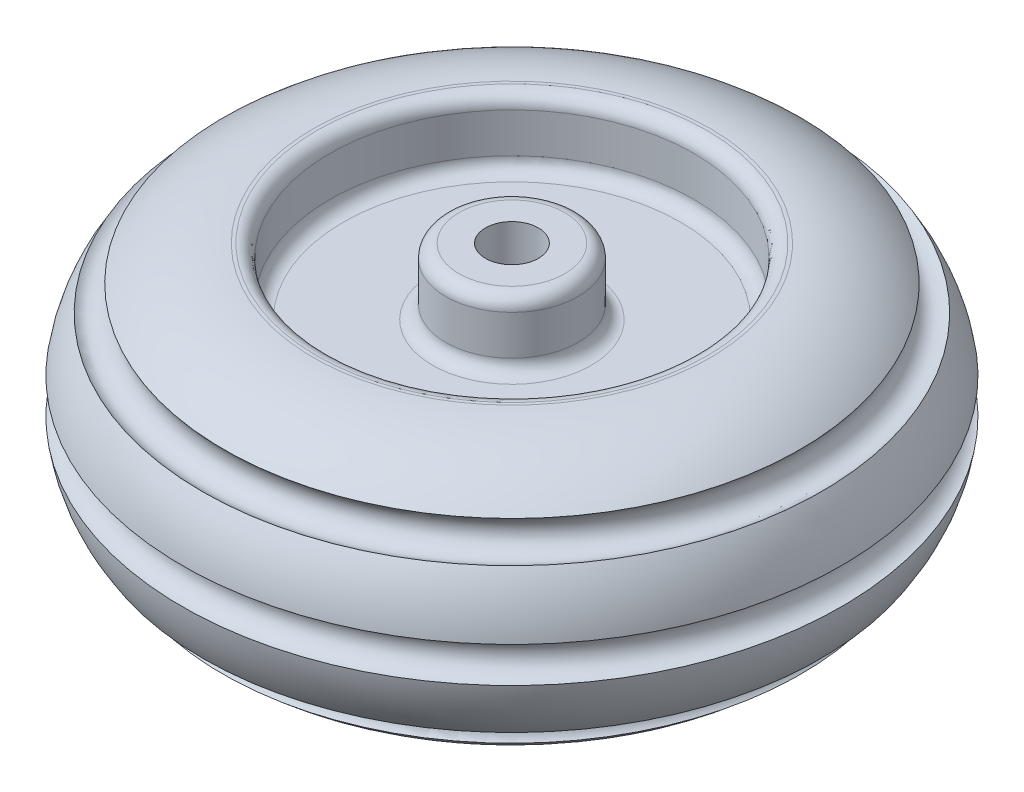
ISO-10303-21;
HEADER;
FILE_DESCRIPTION(('STEP AP214'),'2;1');
FILE_NAME('part.step','',(''),(''),'','','');
FILE_SCHEMA(('AUTOMOTIVE_DESIGN { 1 0 10303 214 1 1 1 1 }'));
ENDSEC;
DATA;
#1=APPLICATION_CONTEXT('core data for automotive mechanical design processes');
#2=APPLICATION_PROTOCOL_DEFINITION('international standard','automotive_design',2000,#1);
#3=PRODUCT_CONTEXT('',#1,'mechanical');
#4=PRODUCT('Part','Part','',(#3));
#5=PRODUCT_RELATED_PRODUCT_CATEGORY('part','',(#4));
#6=PRODUCT_DEFINITION_FORMATION('','',#4);
#7=PRODUCT_DEFINITION_CONTEXT('part definition',#1,'design');
#8=PRODUCT_DEFINITION('design','',#6,#7);
#9=PRODUCT_DEFINITION_SHAPE('','',#8);
#10=(LENGTH_UNIT() NAMED_UNIT(*) SI_UNIT(.MILLI.,.METRE.));
#11=(NAMED_UNIT(*) PLANE_ANGLE_UNIT() SI_UNIT($,.RADIAN.));
#12=(NAMED_UNIT(*) SI_UNIT($,.STERADIAN.) SOLID_ANGLE_UNIT());
#13=UNCERTAINTY_MEASURE_WITH_UNIT(LENGTH_MEASURE(1.E-05),#10,'distance_accuracy_value','');
#14=(GEOMETRIC_REPRESENTATION_CONTEXT(3) GLOBAL_UNCERTAINTY_ASSIGNED_CONTEXT((#13)) GLOBAL_UNIT_ASSIGNED_CONTEXT((#10,
#11,#12)) REPRESENTATION_CONTEXT('',''));
#15=CARTESIAN_POINT('',(0.,0.,0.));
#16=DIRECTION('',(0.,0.,1.));
#17=DIRECTION('',(1.,0.,0.));
#18=AXIS2_PLACEMENT_3D('',#15,#16,#17);
#19=CARTESIAN_POINT('',(22.5,100.,0.));
#20=DIRECTION('',(0.,1.,0.));
#21=DIRECTION('',(0.,0.,1.));
#22=AXIS2_PLACEMENT_3D('',#19,#20,#21);
#23=PLANE('',#22);
#24=CARTESIAN_POINT('',(22.5,100.,0.));
#25=DIRECTION('',(0.,-1.,0.));
#26=DIRECTION('',(0.,0.,-1.));
#27=AXIS2_PLACEMENT_3D('',#24,#25,#26);
#28=CIRCLE('',#27,20.);
#29=CARTESIAN_POINT('',(22.5,100.,-20.));
#30=VERTEX_POINT('',#29);
#31=EDGE_CURVE('E114',#30,#30,#28,.T.);
#32=ORIENTED_EDGE('',*,*,#31,.T.);
#33=EDGE_LOOP('',(#32));
#34=FACE_BOUND('',#33,.T.);
#35=CARTESIAN_POINT('',(22.5,100.,0.));
#36=DIRECTION('',(0.,-1.,0.));
#37=DIRECTION('',(0.,0.,-1.));
#38=AXIS2_PLACEMENT_3D('',#35,#36,#37);
#39=CIRCLE('',#38,40.);
#40=CARTESIAN_POINT('',(22.5,100.,-40.));
#41=VERTEX_POINT('',#40);
#42=EDGE_CURVE('E10',#41,#41,#39,.T.);
#43=ORIENTED_EDGE('',*,*,#42,.F.);
#44=EDGE_LOOP('',(#43));
#45=FACE_BOUND('',#44,.T.);
#46=ADVANCED_FACE('F35',(#34,#45),#23,.T.);
#47=CARTESIAN_POINT('',(22.5,90.,0.));
#48=DIRECTION('',(0.,-1.,0.));
#49=DIRECTION('',(0.,0.,-1.));
#50=AXIS2_PLACEMENT_3D('',#47,#48,#49);
#51=TOROIDAL_SURFACE('',#50,40.,10.);
#52=ORIENTED_EDGE('',*,*,#42,.T.);
#53=EDGE_LOOP('',(#52));
#54=FACE_BOUND('',#53,.T.);
#55=CARTESIAN_POINT('',(22.5,90.,0.));
#56=DIRECTION('',(0.,-1.,0.));
#57=DIRECTION('',(0.,0.,-1.));
#58=AXIS2_PLACEMENT_3D('',#55,#56,#57);
#59=CIRCLE('',#58,50.);
#60=CARTESIAN_POINT('',(22.5,90.,-50.));
#61=VERTEX_POINT('',#60);
#62=EDGE_CURVE('E41',#61,#61,#59,.T.);
#63=ORIENTED_EDGE('',*,*,#62,.F.);
#64=EDGE_LOOP('',(#63));
#65=FACE_BOUND('',#64,.T.);
#66=ADVANCED_FACE('F147',(#54,#65),#51,.T.);
#67=CARTESIAN_POINT('',(22.5,-100.,0.));
#68=DIRECTION('',(0.,-1.,0.));
#69=DIRECTION('',(0.,0.,-1.));
#70=AXIS2_PLACEMENT_3D('',#67,#68,#69);
#71=CYLINDRICAL_SURFACE('',#70,50.);
#72=ORIENTED_EDGE('',*,*,#62,.T.);
#73=EDGE_LOOP('',(#72));
#74=FACE_BOUND('',#73,.T.);
#75=CARTESIAN_POINT('',(22.5,60.,0.));
#76=DIRECTION('',(0.,-1.,0.));
#77=DIRECTION('',(0.,0.,-1.));
#78=AXIS2_PLACEMENT_3D('',#75,#76,#77);
#79=CIRCLE('',#78,50.);
#80=CARTESIAN_POINT('',(22.5,60.,-50.));
#81=VERTEX_POINT('',#80);
#82=EDGE_CURVE('E45',#81,#81,#79,.T.);
#83=ORIENTED_EDGE('',*,*,#82,.F.);
#84=EDGE_LOOP('',(#83));
#85=FACE_BOUND('',#84,.T.);
#86=ADVANCED_FACE('F151',(#74,#85),#71,.T.);
#87=CARTESIAN_POINT('',(22.5,60.,0.));
#88=DIRECTION('',(0.,-1.,0.));
#89=DIRECTION('',(0.,0.,-1.));
#90=AXIS2_PLACEMENT_3D('',#87,#88,#89);
#91=TOROIDAL_SURFACE('',#90,60.,10.);
#92=ORIENTED_EDGE('',*,*,#82,.T.);
#93=EDGE_LOOP('',(#92));
#94=FACE_BOUND('',#93,.T.);
#95=CARTESIAN_POINT('',(22.5,50.,0.));
#96=DIRECTION('',(0.,-1.,0.));
#97=DIRECTION('',(0.,0.,-1.));
#98=AXIS2_PLACEMENT_3D('',#95,#96,#97);
#99=CIRCLE('',#98,60.);
#100=CARTESIAN_POINT('',(22.5,50.,-60.));
#101=VERTEX_POINT('',#100);
#102=EDGE_CURVE('E49',#101,#101,#99,.T.);
#103=ORIENTED_EDGE('',*,*,#102,.F.);
#104=EDGE_LOOP('',(#103));
#105=FACE_BOUND('',#104,.T.);
#106=ADVANCED_FACE('F155',(#94,#105),#91,.F.);
#107=CARTESIAN_POINT('',(82.5,50.,0.));
#108=DIRECTION('',(0.,1.,0.));
#109=DIRECTION('',(0.,0.,1.));
#110=AXIS2_PLACEMENT_3D('',#107,#108,#109);
#111=PLANE('',#110);
#112=ORIENTED_EDGE('',*,*,#102,.T.);
#113=EDGE_LOOP('',(#112));
#114=FACE_BOUND('',#113,.T.);
#115=CARTESIAN_POINT('',(22.5,50.,0.));
#116=DIRECTION('',(0.,-1.,0.));
#117=DIRECTION('',(0.,0.,-1.));
#118=AXIS2_PLACEMENT_3D('',#115,#116,#117);
#119=CIRCLE('',#118,127.5);
#120=CARTESIAN_POINT('',(22.5,50.,-127.5));
#121=VERTEX_POINT('',#120);
#122=EDGE_CURVE('E54',#121,#121,#119,.T.);
#123=ORIENTED_EDGE('',*,*,#122,.F.);
#124=EDGE_LOOP('',(#123));
#125=FACE_BOUND('',#124,.T.);
#126=ADVANCED_FACE('F161',(#114,#125),#111,.T.);
#127=CARTESIAN_POINT('',(22.5,60.,0.));
#128=DIRECTION('',(0.,-1.,0.));
#129=DIRECTION('',(0.,0.,-1.));
#130=AXIS2_PLACEMENT_3D('',#127,#128,#129);
#131=TOROIDAL_SURFACE('',#130,127.5,10.);
#132=ORIENTED_EDGE('',*,*,#122,.T.);
#133=EDGE_LOOP('',(#132));
#134=FACE_BOUND('',#133,.T.);
#135=CARTESIAN_POINT('',(22.5,60.0000000000001,0.));
#136=DIRECTION('',(0.,-1.,0.));
#137=DIRECTION('',(0.,0.,-1.));
#138=AXIS2_PLACEMENT_3D('',#135,#136,#137);
#139=CIRCLE('',#138,137.5);
#140=CARTESIAN_POINT('',(22.5,60.0000000000001,-137.5));
#141=VERTEX_POINT('',#140);
#142=EDGE_CURVE('E57',#141,#141,#139,.T.);
#143=ORIENTED_EDGE('',*,*,#142,.F.);
#144=EDGE_LOOP('',(#143));
#145=FACE_BOUND('',#144,.T.);
#146=ADVANCED_FACE('F165',(#134,#145),#131,.F.);
#147=CARTESIAN_POINT('',(22.5,-100.,0.));
#148=DIRECTION('',(0.,-1.,0.));
#149=DIRECTION('',(0.,0.,-1.));
#150=AXIS2_PLACEMENT_3D('',#147,#148,#149);
#151=CYLINDRICAL_SURFACE('',#150,137.5);
#152=ORIENTED_EDGE('',*,*,#142,.T.);
#153=EDGE_LOOP('',(#152));
#154=FACE_BOUND('',#153,.T.);
#155=CARTESIAN_POINT('',(22.5,90.,0.));
#156=DIRECTION('',(0.,-1.,0.));
#157=DIRECTION('',(0.,0.,-1.));
#158=AXIS2_PLACEMENT_3D('',#155,#156,#157);
#159=CIRCLE('',#158,137.5);
#160=CARTESIAN_POINT('',(22.5,90.,-137.5));
#161=VERTEX_POINT('',#160);
#162=EDGE_CURVE('E60',#161,#161,#159,.T.);
#163=ORIENTED_EDGE('',*,*,#162,.F.);
#164=EDGE_LOOP('',(#163));
#165=FACE_BOUND('',#164,.T.);
#166=ADVANCED_FACE('F169',(#154,#165),#151,.F.);
#167=CARTESIAN_POINT('',(22.5,90.,0.));
#168=DIRECTION('',(0.,-1.,0.));
#169=DIRECTION('',(0.,0.,-1.));
#170=AXIS2_PLACEMENT_3D('',#167,#168,#169);
#171=TOROIDAL_SURFACE('',#170,147.5,10.);
#172=ORIENTED_EDGE('',*,*,#162,.T.);
#173=EDGE_LOOP('',(#172));
#174=FACE_BOUND('',#173,.T.);
#175=CARTESIAN_POINT('',(22.5,100.,0.));
#176=DIRECTION('',(0.,-1.,0.));
#177=DIRECTION('',(0.,0.,-1.));
#178=AXIS2_PLACEMENT_3D('',#175,#176,#177);
#179=CIRCLE('',#178,147.5);
#180=CARTESIAN_POINT('',(22.5,100.,-147.5));
#181=VERTEX_POINT('',#180);
#182=EDGE_CURVE('E63',#181,#181,#179,.T.);
#183=ORIENTED_EDGE('',*,*,#182,.F.);
#184=EDGE_LOOP('',(#183));
#185=FACE_BOUND('',#184,.T.);
#186=ADVANCED_FACE('F173',(#174,#185),#171,.T.);
#187=CARTESIAN_POINT('',(170.,100.,0.));
#188=DIRECTION('',(0.,1.,0.));
#189=DIRECTION('',(0.,0.,1.));
#190=AXIS2_PLACEMENT_3D('',#187,#188,#189);
#191=PLANE('',#190);
#192=ORIENTED_EDGE('',*,*,#182,.T.);
#193=EDGE_LOOP('',(#192));
#194=FACE_BOUND('',#193,.T.);
#195=CARTESIAN_POINT('',(22.5,100.,0.));
#196=DIRECTION('',(0.,-1.,0.));
#197=DIRECTION('',(0.,0.,-1.));
#198=AXIS2_PLACEMENT_3D('',#195,#196,#197);
#199=CIRCLE('',#198,150.);
#200=CARTESIAN_POINT('',(22.5,100.,-150.));
#201=VERTEX_POINT('',#200);
#202=EDGE_CURVE('E66',#201,#201,#199,.T.);
#203=ORIENTED_EDGE('',*,*,#202,.F.);
#204=EDGE_LOOP('',(#203));
#205=FACE_BOUND('',#204,.T.);
#206=ADVANCED_FACE('F177',(#194,#205),#191,.T.);
#207=CARTESIAN_POINT('',(22.5,0.,0.));
#208=DIRECTION('',(0.,-1.,0.));
#209=DIRECTION('',(0.,0.,-1.));
#210=AXIS2_PLACEMENT_3D('',#207,#208,#209);
#211=TOROIDAL_SURFACE('',#210,150.,100.);
#212=ORIENTED_EDGE('',*,*,#202,.T.);
#213=EDGE_LOOP('',(#212));
#214=FACE_BOUND('',#213,.T.);
#215=CARTESIAN_POINT('',(22.5,73.6561850241107,0.));
#216=DIRECTION('',(0.,-1.,0.));
#217=DIRECTION('',(0.,0.,-1.));
#218=AXIS2_PLACEMENT_3D('',#215,#216,#217);
#219=CIRCLE('',#218,217.637019506288);
#220=CARTESIAN_POINT('',(22.5,73.6561850241107,-217.637019506288));
#221=VERTEX_POINT('',#220);
#222=EDGE_CURVE('E69',#221,#221,#219,.T.);
#223=ORIENTED_EDGE('',*,*,#222,.F.);
#224=EDGE_LOOP('',(#223));
#225=FACE_BOUND('',#224,.T.);
#226=ADVANCED_FACE('F181',(#214,#225),#211,.T.);
#227=CARTESIAN_POINT('',(22.5,64.5026489599969,0.));
#228=DIRECTION('',(0.,-1.,0.));
#229=DIRECTION('',(0.,0.,-1.));
#230=AXIS2_PLACEMENT_3D('',#227,#228,#229);
#231=TOROIDAL_SURFACE('',#230,226.416021076365,12.6829843114482);
#232=ORIENTED_EDGE('',*,*,#222,.T.);
#233=EDGE_LOOP('',(#232));
#234=FACE_BOUND('',#233,.T.);
#235=CARTESIAN_POINT('',(22.5,54.3115355979817,0.));
#236=DIRECTION('',(0.,-1.,0.));
#237=DIRECTION('',(0.,0.,-1.));
#238=AXIS2_PLACEMENT_3D('',#235,#236,#237);
#239=CIRCLE('',#238,233.965809118886);
#240=CARTESIAN_POINT('',(22.5,54.3115355979817,-233.965809118886));
#241=VERTEX_POINT('',#240);
#242=EDGE_CURVE('E72',#241,#241,#239,.T.);
#243=ORIENTED_EDGE('',*,*,#242,.F.);
#244=EDGE_LOOP('',(#243));
#245=FACE_BOUND('',#244,.T.);
#246=ADVANCED_FACE('F185',(#234,#245),#231,.F.);
#247=CARTESIAN_POINT('',(22.5,0.,0.));
#248=DIRECTION('',(0.,-1.,0.));
#249=DIRECTION('',(0.,0.,-1.));
#250=AXIS2_PLACEMENT_3D('',#247,#248,#249);
#251=TOROIDAL_SURFACE('',#250,150.,100.);
#252=ORIENTED_EDGE('',*,*,#242,.T.);
#253=EDGE_LOOP('',(#252));
#254=FACE_BOUND('',#253,.T.);
#255=CARTESIAN_POINT('',(22.5,13.4448012327932,0.));
#256=DIRECTION('',(0.,-1.,0.));
#257=DIRECTION('',(0.,0.,-1.));
#258=AXIS2_PLACEMENT_3D('',#255,#256,#257);
#259=CIRCLE('',#258,249.092064868034);
#260=CARTESIAN_POINT('',(22.5,13.4448012327932,-249.092064868034));
#261=VERTEX_POINT('',#260);
#262=EDGE_CURVE('E75',#261,#261,#259,.T.);
#263=ORIENTED_EDGE('',*,*,#262,.F.);
#264=EDGE_LOOP('',(#263));
#265=FACE_BOUND('',#264,.T.);
#266=ADVANCED_FACE('F189',(#254,#265),#251,.T.);
#267=CARTESIAN_POINT('',(22.5,0.,0.));
#268=DIRECTION('',(0.,-1.,0.));
#269=DIRECTION('',(0.,0.,-1.));
#270=AXIS2_PLACEMENT_3D('',#267,#268,#269);
#271=TOROIDAL_SURFACE('',#270,250.,13.4754230506198);
#272=ORIENTED_EDGE('',*,*,#262,.T.);
#273=EDGE_LOOP('',(#272));
#274=FACE_BOUND('',#273,.T.);
#275=CARTESIAN_POINT('',(22.5,-13.4448012327931,0.));
#276=DIRECTION('',(0.,-1.,0.));
#277=DIRECTION('',(0.,0.,-1.));
#278=AXIS2_PLACEMENT_3D('',#275,#276,#277);
#279=CIRCLE('',#278,249.092064868034);
#280=CARTESIAN_POINT('',(22.5,-13.4448012327931,-249.092064868034));
#281=VERTEX_POINT('',#280);
#282=EDGE_CURVE('E78',#281,#281,#279,.T.);
#283=ORIENTED_EDGE('',*,*,#282,.F.);
#284=EDGE_LOOP('',(#283));
#285=FACE_BOUND('',#284,.T.);
#286=ADVANCED_FACE('F193',(#274,#285),#271,.F.);
#287=CARTESIAN_POINT('',(22.5,0.,0.));
#288=DIRECTION('',(0.,-1.,0.));
#289=DIRECTION('',(0.,0.,-1.));
#290=AXIS2_PLACEMENT_3D('',#287,#288,#289);
#291=TOROIDAL_SURFACE('',#290,150.,100.);
#292=ORIENTED_EDGE('',*,*,#282,.T.);
#293=EDGE_LOOP('',(#292));
#294=FACE_BOUND('',#293,.T.);
#295=CARTESIAN_POINT('',(22.5,-55.3986727416396,0.));
#296=DIRECTION('',(0.,-1.,0.));
#297=DIRECTION('',(0.,0.,-1.));
#298=AXIS2_PLACEMENT_3D('',#295,#296,#297);
#299=CIRCLE('',#298,233.252549861639);
#300=CARTESIAN_POINT('',(22.5,-55.3986727416396,-233.252549861639));
#301=VERTEX_POINT('',#300);
#302=EDGE_CURVE('E81',#301,#301,#299,.T.);
#303=ORIENTED_EDGE('',*,*,#302,.F.);
#304=EDGE_LOOP('',(#303));
#305=FACE_BOUND('',#304,.T.);
#306=ADVANCED_FACE('F197',(#294,#305),#291,.T.);
#307=CARTESIAN_POINT('',(22.5,-64.502648959997,0.));
#308=DIRECTION('',(0.,-1.,0.));
#309=DIRECTION('',(0.,0.,-1.));
#310=AXIS2_PLACEMENT_3D('',#307,#308,#309);
#311=TOROIDAL_SURFACE('',#310,226.416021076365,11.3851002989128);
#312=ORIENTED_EDGE('',*,*,#302,.T.);
#313=EDGE_LOOP('',(#312));
#314=FACE_BOUND('',#313,.T.);
#315=CARTESIAN_POINT('',(22.5,-72.7705385605349,0.));
#316=DIRECTION('',(0.,-1.,0.));
#317=DIRECTION('',(0.,0.,-1.));
#318=AXIS2_PLACEMENT_3D('',#315,#316,#317);
#319=CIRCLE('',#318,218.588983937727);
#320=CARTESIAN_POINT('',(22.5,-72.7705385605349,-218.588983937727));
#321=VERTEX_POINT('',#320);
#322=EDGE_CURVE('E84',#321,#321,#319,.T.);
#323=ORIENTED_EDGE('',*,*,#322,.F.);
#324=EDGE_LOOP('',(#323));
#325=FACE_BOUND('',#324,.T.);
#326=ADVANCED_FACE('F201',(#314,#325),#311,.F.);
#327=CARTESIAN_POINT('',(22.5,0.,0.));
#328=DIRECTION('',(0.,-1.,0.));
#329=DIRECTION('',(0.,0.,-1.));
#330=AXIS2_PLACEMENT_3D('',#327,#328,#329);
#331=TOROIDAL_SURFACE('',#330,150.,100.);
#332=ORIENTED_EDGE('',*,*,#322,.T.);
#333=EDGE_LOOP('',(#332));
#334=FACE_BOUND('',#333,.T.);
#335=CARTESIAN_POINT('',(22.5,-100.,0.));
#336=DIRECTION('',(0.,-1.,0.));
#337=DIRECTION('',(0.,0.,-1.));
#338=AXIS2_PLACEMENT_3D('',#335,#336,#337);
#339=CIRCLE('',#338,150.);
#340=CARTESIAN_POINT('',(22.5,-100.,-150.));
#341=VERTEX_POINT('',#340);
#342=EDGE_CURVE('E87',#341,#341,#339,.T.);
#343=ORIENTED_EDGE('',*,*,#342,.F.);
#344=EDGE_LOOP('',(#343));
#345=FACE_BOUND('',#344,.T.);
#346=ADVANCED_FACE('F205',(#334,#345),#331,.T.);
#347=CARTESIAN_POINT('',(170.,-100.,0.));
#348=DIRECTION('',(0.,-1.,0.));
#349=DIRECTION('',(0.,0.,-1.));
#350=AXIS2_PLACEMENT_3D('',#347,#348,#349);
#351=PLANE('',#350);
#352=ORIENTED_EDGE('',*,*,#342,.T.);
#353=EDGE_LOOP('',(#352));
#354=FACE_BOUND('',#353,.T.);
#355=CARTESIAN_POINT('',(22.5,-100.,0.));
#356=DIRECTION('',(0.,-1.,0.));
#357=DIRECTION('',(0.,0.,-1.));
#358=AXIS2_PLACEMENT_3D('',#355,#356,#357);
#359=CIRCLE('',#358,147.5);
#360=CARTESIAN_POINT('',(22.5,-100.,-147.5));
#361=VERTEX_POINT('',#360);
#362=EDGE_CURVE('E90',#361,#361,#359,.T.);
#363=ORIENTED_EDGE('',*,*,#362,.F.);
#364=EDGE_LOOP('',(#363));
#365=FACE_BOUND('',#364,.T.);
#366=ADVANCED_FACE('F209',(#354,#365),#351,.T.);
#367=CARTESIAN_POINT('',(22.5,-90.,0.));
#368=DIRECTION('',(0.,-1.,0.));
#369=DIRECTION('',(0.,0.,-1.));
#370=AXIS2_PLACEMENT_3D('',#367,#368,#369);
#371=TOROIDAL_SURFACE('',#370,147.5,10.);
#372=ORIENTED_EDGE('',*,*,#362,.T.);
#373=EDGE_LOOP('',(#372));
#374=FACE_BOUND('',#373,.T.);
#375=CARTESIAN_POINT('',(22.5,-90.,0.));
#376=DIRECTION('',(0.,-1.,0.));
#377=DIRECTION('',(0.,0.,-1.));
#378=AXIS2_PLACEMENT_3D('',#375,#376,#377);
#379=CIRCLE('',#378,137.5);
#380=CARTESIAN_POINT('',(22.5,-90.,-137.5));
#381=VERTEX_POINT('',#380);
#382=EDGE_CURVE('E93',#381,#381,#379,.T.);
#383=ORIENTED_EDGE('',*,*,#382,.F.);
#384=EDGE_LOOP('',(#383));
#385=FACE_BOUND('',#384,.T.);
#386=ADVANCED_FACE('F213',(#374,#385),#371,.T.);
#387=CARTESIAN_POINT('',(22.5,-100.,0.));
#388=DIRECTION('',(0.,-1.,0.));
#389=DIRECTION('',(0.,0.,-1.));
#390=AXIS2_PLACEMENT_3D('',#387,#388,#389);
#391=CYLINDRICAL_SURFACE('',#390,137.5);
#392=ORIENTED_EDGE('',*,*,#382,.T.);
#393=EDGE_LOOP('',(#392));
#394=FACE_BOUND('',#393,.T.);
#395=CARTESIAN_POINT('',(22.5,-60.,0.));
#396=DIRECTION('',(0.,-1.,0.));
#397=DIRECTION('',(0.,0.,-1.));
#398=AXIS2_PLACEMENT_3D('',#395,#396,#397);
#399=CIRCLE('',#398,137.5);
#400=CARTESIAN_POINT('',(22.5,-60.,-137.5));
#401=VERTEX_POINT('',#400);
#402=EDGE_CURVE('E96',#401,#401,#399,.T.);
#403=ORIENTED_EDGE('',*,*,#402,.F.);
#404=EDGE_LOOP('',(#403));
#405=FACE_BOUND('',#404,.T.);
#406=ADVANCED_FACE('F217',(#394,#405),#391,.F.);
#407=CARTESIAN_POINT('',(22.5,-60.,0.));
#408=DIRECTION('',(0.,-1.,0.));
#409=DIRECTION('',(0.,0.,-1.));
#410=AXIS2_PLACEMENT_3D('',#407,#408,#409);
#411=TOROIDAL_SURFACE('',#410,127.5,10.);
#412=ORIENTED_EDGE('',*,*,#402,.T.);
#413=EDGE_LOOP('',(#412));
#414=FACE_BOUND('',#413,.T.);
#415=CARTESIAN_POINT('',(22.5,-50.,0.));
#416=DIRECTION('',(0.,-1.,0.));
#417=DIRECTION('',(0.,0.,-1.));
#418=AXIS2_PLACEMENT_3D('',#415,#416,#417);
#419=CIRCLE('',#418,127.5);
#420=CARTESIAN_POINT('',(22.5,-50.,-127.5));
#421=VERTEX_POINT('',#420);
#422=EDGE_CURVE('E99',#421,#421,#419,.T.);
#423=ORIENTED_EDGE('',*,*,#422,.F.);
#424=EDGE_LOOP('',(#423));
#425=FACE_BOUND('',#424,.T.);
#426=ADVANCED_FACE('F221',(#414,#425),#411,.F.);
#427=CARTESIAN_POINT('',(82.5,-50.,0.));
#428=DIRECTION('',(0.,-1.,0.));
#429=DIRECTION('',(0.,0.,-1.));
#430=AXIS2_PLACEMENT_3D('',#427,#428,#429);
#431=PLANE('',#430);
#432=ORIENTED_EDGE('',*,*,#422,.T.);
#433=EDGE_LOOP('',(#432));
#434=FACE_BOUND('',#433,.T.);
#435=CARTESIAN_POINT('',(22.5,-50.,0.));
#436=DIRECTION('',(0.,-1.,0.));
#437=DIRECTION('',(0.,0.,-1.));
#438=AXIS2_PLACEMENT_3D('',#435,#436,#437);
#439=CIRCLE('',#438,60.);
#440=CARTESIAN_POINT('',(22.5,-50.,-60.));
#441=VERTEX_POINT('',#440);
#442=EDGE_CURVE('E102',#441,#441,#439,.T.);
#443=ORIENTED_EDGE('',*,*,#442,.F.);
#444=EDGE_LOOP('',(#443));
#445=FACE_BOUND('',#444,.T.);
#446=ADVANCED_FACE('F225',(#434,#445),#431,.T.);
#447=CARTESIAN_POINT('',(22.5,-60.,0.));
#448=DIRECTION('',(0.,-1.,0.));
#449=DIRECTION('',(0.,0.,-1.));
#450=AXIS2_PLACEMENT_3D('',#447,#448,#449);
#451=TOROIDAL_SURFACE('',#450,60.,10.);
#452=ORIENTED_EDGE('',*,*,#442,.T.);
#453=EDGE_LOOP('',(#452));
#454=FACE_BOUND('',#453,.T.);
#455=CARTESIAN_POINT('',(22.5,-60.,0.));
#456=DIRECTION('',(0.,-1.,0.));
#457=DIRECTION('',(0.,0.,-1.));
#458=AXIS2_PLACEMENT_3D('',#455,#456,#457);
#459=CIRCLE('',#458,50.);
#460=CARTESIAN_POINT('',(22.5,-60.,-50.));
#461=VERTEX_POINT('',#460);
#462=EDGE_CURVE('E105',#461,#461,#459,.T.);
#463=ORIENTED_EDGE('',*,*,#462,.F.);
#464=EDGE_LOOP('',(#463));
#465=FACE_BOUND('',#464,.T.);
#466=ADVANCED_FACE('F143',(#454,#465),#451,.F.);
#467=CARTESIAN_POINT('',(22.5,-100.,0.));
#468=DIRECTION('',(0.,-1.,0.));
#469=DIRECTION('',(0.,0.,-1.));
#470=AXIS2_PLACEMENT_3D('',#467,#468,#469);
#471=CYLINDRICAL_SURFACE('',#470,50.);
#472=ORIENTED_EDGE('',*,*,#462,.T.);
#473=EDGE_LOOP('',(#472));
#474=FACE_BOUND('',#473,.T.);
#475=CARTESIAN_POINT('',(22.5,-90.,0.));
#476=DIRECTION('',(0.,-1.,0.));
#477=DIRECTION('',(0.,0.,-1.));
#478=AXIS2_PLACEMENT_3D('',#475,#476,#477);
#479=CIRCLE('',#478,50.);
#480=CARTESIAN_POINT('',(22.5,-90.,-50.));
#481=VERTEX_POINT('',#480);
#482=EDGE_CURVE('E108',#481,#481,#479,.T.);
#483=ORIENTED_EDGE('',*,*,#482,.F.);
#484=EDGE_LOOP('',(#483));
#485=FACE_BOUND('',#484,.T.);
#486=ADVANCED_FACE('F137',(#474,#485),#471,.T.);
#487=CARTESIAN_POINT('',(22.5,-90.,0.));
#488=DIRECTION('',(0.,-1.,0.));
#489=DIRECTION('',(0.,0.,-1.));
#490=AXIS2_PLACEMENT_3D('',#487,#488,#489);
#491=TOROIDAL_SURFACE('',#490,40.,10.);
#492=ORIENTED_EDGE('',*,*,#482,.T.);
#493=EDGE_LOOP('',(#492));
#494=FACE_BOUND('',#493,.T.);
#495=CARTESIAN_POINT('',(22.5,-100.,0.));
#496=DIRECTION('',(0.,-1.,0.));
#497=DIRECTION('',(0.,0.,-1.));
#498=AXIS2_PLACEMENT_3D('',#495,#496,#497);
#499=CIRCLE('',#498,40.);
#500=CARTESIAN_POINT('',(22.5,-100.,-40.));
#501=VERTEX_POINT('',#500);
#502=EDGE_CURVE('E111',#501,#501,#499,.T.);
#503=ORIENTED_EDGE('',*,*,#502,.F.);
#504=EDGE_LOOP('',(#503));
#505=FACE_BOUND('',#504,.T.);
#506=ADVANCED_FACE('F132',(#494,#505),#491,.T.);
#507=CARTESIAN_POINT('',(22.5,-100.,0.));
#508=DIRECTION('',(0.,-1.,0.));
#509=DIRECTION('',(0.,0.,-1.));
#510=AXIS2_PLACEMENT_3D('',#507,#508,#509);
#511=PLANE('',#510);
#512=CARTESIAN_POINT('',(22.5,-100.,0.));
#513=DIRECTION('',(0.,-1.,0.));
#514=DIRECTION('',(0.,0.,-1.));
#515=AXIS2_PLACEMENT_3D('',#512,#513,#514);
#516=CIRCLE('',#515,20.);
#517=CARTESIAN_POINT('',(22.5,-100.,-20.));
#518=VERTEX_POINT('',#517);
#519=EDGE_CURVE('E115',#518,#518,#516,.T.);
#520=ORIENTED_EDGE('',*,*,#519,.F.);
#521=EDGE_LOOP('',(#520));
#522=FACE_BOUND('',#521,.T.);
#523=ORIENTED_EDGE('',*,*,#502,.T.);
#524=EDGE_LOOP('',(#523));
#525=FACE_BOUND('',#524,.T.);
#526=ADVANCED_FACE('F126',(#522,#525),#511,.T.);
#527=CARTESIAN_POINT('',(22.5,100.,0.));
#528=DIRECTION('',(0.,-1.,0.));
#529=DIRECTION('',(0.,0.,-1.));
#530=AXIS2_PLACEMENT_3D('',#527,#528,#529);
#531=CYLINDRICAL_SURFACE('',#530,20.);
#532=ORIENTED_EDGE('',*,*,#31,.F.);
#533=EDGE_LOOP('',(#532));
#534=FACE_BOUND('',#533,.T.);
#535=ORIENTED_EDGE('',*,*,#519,.T.);
#536=EDGE_LOOP('',(#535));
#537=FACE_BOUND('',#536,.T.);
#538=ADVANCED_FACE('F123',(#534,#537),#531,.F.);
#539=CLOSED_SHELL('',(#46,#66,#86,#106,#126,#146,#166,#186,#206,#226,#246,#266,#286,#306,#326,
#346,#366,#386,#406,#426,#446,#466,#486,#506,#526,#538));
#540=MANIFOLD_SOLID_BREP('B2',#539);
#541=ADVANCED_BREP_SHAPE_REPRESENTATION('',(#18,#540),#14);
#542=SHAPE_DEFINITION_REPRESENTATION(#9,#541);
ENDSEC;
END-ISO-10303-21;
